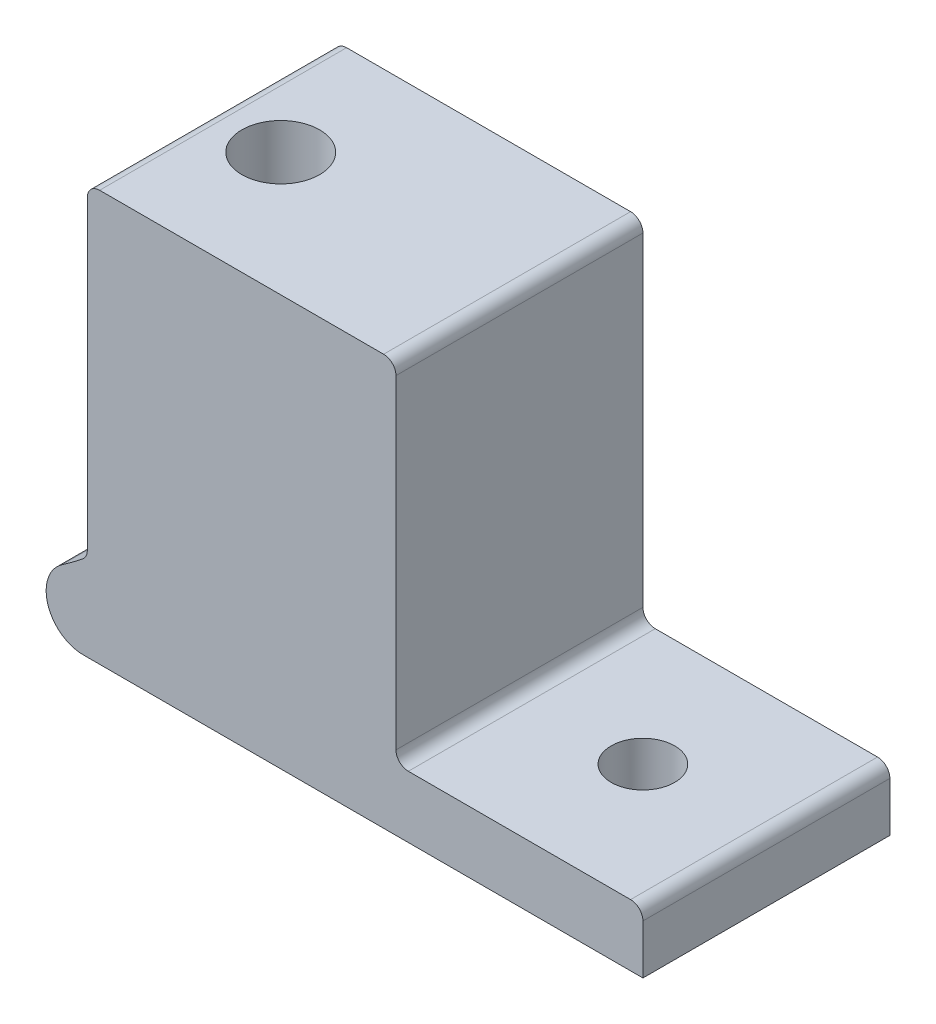
ISO-10303-21;
HEADER;
FILE_DESCRIPTION(('STEP AP214'),'2;1');
FILE_NAME('part.step','',(''),(''),'','','');
FILE_SCHEMA(('AUTOMOTIVE_DESIGN { 1 0 10303 214 1 1 1 1 }'));
ENDSEC;
DATA;
#1=APPLICATION_CONTEXT('core data for automotive mechanical design processes');
#2=APPLICATION_PROTOCOL_DEFINITION('international standard','automotive_design',2000,#1);
#3=PRODUCT_CONTEXT('',#1,'mechanical');
#4=PRODUCT('Part','Part','',(#3));
#5=PRODUCT_RELATED_PRODUCT_CATEGORY('part','',(#4));
#6=PRODUCT_DEFINITION_FORMATION('','',#4);
#7=PRODUCT_DEFINITION_CONTEXT('part definition',#1,'design');
#8=PRODUCT_DEFINITION('design','',#6,#7);
#9=PRODUCT_DEFINITION_SHAPE('','',#8);
#10=(LENGTH_UNIT() NAMED_UNIT(*) SI_UNIT(.MILLI.,.METRE.));
#11=(NAMED_UNIT(*) PLANE_ANGLE_UNIT() SI_UNIT($,.RADIAN.));
#12=(NAMED_UNIT(*) SI_UNIT($,.STERADIAN.) SOLID_ANGLE_UNIT());
#13=UNCERTAINTY_MEASURE_WITH_UNIT(LENGTH_MEASURE(1.E-05),#10,'distance_accuracy_value','');
#14=(GEOMETRIC_REPRESENTATION_CONTEXT(3) GLOBAL_UNCERTAINTY_ASSIGNED_CONTEXT((#13)) GLOBAL_UNIT_ASSIGNED_CONTEXT((#10,
#11,#12)) REPRESENTATION_CONTEXT('',''));
#15=CARTESIAN_POINT('',(0.,0.,0.));
#16=DIRECTION('',(0.,0.,1.));
#17=DIRECTION('',(1.,0.,0.));
#18=AXIS2_PLACEMENT_3D('',#15,#16,#17);
#19=CARTESIAN_POINT('',(0.,0.,12.7));
#20=DIRECTION('',(0.,0.,-1.));
#21=DIRECTION('',(-1.,0.,0.));
#22=AXIS2_PLACEMENT_3D('',#19,#20,#21);
#23=CYLINDRICAL_SURFACE('',#22,38.9999999999999);
#24=CARTESIAN_POINT('',(32.,-22.2934968096077,4.00000000000001));
#25=CARTESIAN_POINT('',(31.8331234852324,-22.5330333355611,3.99999561565649));
#26=CARTESIAN_POINT('',(31.6635558711314,-22.7706840225816,3.98958198545416));
#27=CARTESIAN_POINT('',(31.3200684337904,-23.2408696283417,3.94559163945568));
#28=CARTESIAN_POINT('',(31.1461472387668,-23.4734028901184,3.91200753196114));
#29=CARTESIAN_POINT('',(30.7966355837724,-23.9300954895692,3.81895995582314));
#30=CARTESIAN_POINT('',(30.6210585926834,-24.1542922306732,3.75963261479427));
#31=CARTESIAN_POINT('',(30.2700882068309,-24.5926896437965,3.61159739335414));
#32=CARTESIAN_POINT('',(30.0946948566352,-24.8069024503946,3.52292629939554));
#33=CARTESIAN_POINT('',(29.7626084617116,-25.2041339526433,3.32092946173891));
#34=CARTESIAN_POINT('',(29.6055933370013,-25.388256352554,3.21034083019939));
#35=CARTESIAN_POINT('',(29.2994471967593,-25.7409544753002,2.9574292754624));
#36=CARTESIAN_POINT('',(29.1503125648886,-25.9095373560926,2.81512106753181));
#37=CARTESIAN_POINT('',(28.8891350266257,-26.2001891655891,2.52088448795227));
#38=CARTESIAN_POINT('',(28.7749512642583,-26.3254010510597,2.37401032842275));
#39=CARTESIAN_POINT('',(28.5627667376646,-26.5554659473417,2.05475912698604));
#40=CARTESIAN_POINT('',(28.4647418163483,-26.6603493907313,1.88242089837858));
#41=CARTESIAN_POINT('',(28.3107418389157,-26.8237151431477,1.55391144355306));
#42=CARTESIAN_POINT('',(28.2502590906013,-26.8873289057192,1.4024552633309));
#43=CARTESIAN_POINT('',(28.1728399223758,-26.9683607242981,1.16608268807006));
#44=CARTESIAN_POINT('',(28.1492465561929,-26.9929777890882,1.08573802733644));
#45=CARTESIAN_POINT('',(28.1068979233288,-27.0370713345232,0.922420753107216));
#46=CARTESIAN_POINT('',(28.0881406222463,-27.0565499768432,0.839449261195342));
#47=CARTESIAN_POINT('',(28.0557177327903,-27.0901689362472,0.67086156328984));
#48=CARTESIAN_POINT('',(28.0420864990272,-27.1042732429072,0.585231536100381));
#49=CARTESIAN_POINT('',(28.0203814036598,-27.1267113753442,0.412558123955896));
#50=CARTESIAN_POINT('',(28.0123050489618,-27.1350477898276,0.325515391017926));
#51=CARTESIAN_POINT('',(28.001882511118,-27.1458032718856,0.150719503609792));
#52=CARTESIAN_POINT('',(27.9995360996976,-27.1482225751913,0.0629663775806375));
#53=CARTESIAN_POINT('',(28.000616867332,-27.147107497238,-0.112438053063213));
#54=CARTESIAN_POINT('',(28.0040436153386,-27.143573560473,-0.200089364790828));
#55=CARTESIAN_POINT('',(28.0216876848783,-27.1253636430137,-0.444825611954987));
#56=CARTESIAN_POINT('',(28.0423682770908,-27.1040110045358,-0.601038633682248));
#57=CARTESIAN_POINT('',(28.1009423083963,-27.0432758763674,-0.906419975364352));
#58=CARTESIAN_POINT('',(28.1388372304785,-27.0038918332957,-1.05558768715362));
#59=CARTESIAN_POINT('',(28.231142139416,-26.9073818397128,-1.34916074454141));
#60=CARTESIAN_POINT('',(28.2861030482257,-26.8496622845943,-1.49319511823172));
#61=CARTESIAN_POINT('',(28.4089978305736,-26.7195969632575,-1.76846839636876));
#62=CARTESIAN_POINT('',(28.476938317702,-26.6472437395194,-1.89970072596614));
#63=CARTESIAN_POINT('',(28.6607842593177,-26.4496828011217,-2.21305074611287));
#64=CARTESIAN_POINT('',(28.7832984430327,-26.316517527582,-2.38628749319523));
#65=CARTESIAN_POINT('',(29.0432042509759,-26.0294048218929,-2.70173097014501));
#66=CARTESIAN_POINT('',(29.1806311678749,-25.8754078672634,-2.84386157775276));
#67=CARTESIAN_POINT('',(29.4259024511423,-25.5957242696129,-3.06487418537874));
#68=CARTESIAN_POINT('',(29.5317934852491,-25.4735245563879,-3.15049521753796));
#69=CARTESIAN_POINT('',(29.746436755882,-25.2225445166779,-3.30743714133564));
#70=CARTESIAN_POINT('',(29.8551902839873,-25.0937611940408,-3.37875144806797));
#71=CARTESIAN_POINT('',(30.0742311525285,-24.8308264008898,-3.50822104930676));
#72=CARTESIAN_POINT('',(30.1845197893215,-24.6966701879378,-3.56636440304415));
#73=CARTESIAN_POINT('',(30.4055367017579,-24.4240490090574,-3.6705054496288));
#74=CARTESIAN_POINT('',(30.5162651068742,-24.2855826771278,-3.71649924720499));
#75=CARTESIAN_POINT('',(30.7975713202804,-23.9287599560444,-3.81932548170611));
#76=CARTESIAN_POINT('',(30.9679028485226,-23.707962378115,-3.86841975437551));
#77=CARTESIAN_POINT('',(31.3056233319979,-23.2601963806112,-3.94306462157423));
#78=CARTESIAN_POINT('',(31.4730106384673,-23.033224673998,-3.9686024119455));
#79=CARTESIAN_POINT('',(31.8037736032666,-22.5743248802979,-3.99864046567475));
#80=CARTESIAN_POINT('',(31.9671400323692,-22.3423873292926,-4.00309613910871));
#81=CARTESIAN_POINT('',(32.2885247339905,-21.8753641447709,-3.99281753785568));
#82=CARTESIAN_POINT('',(32.4465437178357,-21.6402789358139,-3.97808582588489));
#83=CARTESIAN_POINT('',(32.8066360824857,-21.0918025316393,-3.92331378911935));
#84=CARTESIAN_POINT('',(33.0064845266695,-20.7776048416269,-3.87664430495575));
#85=CARTESIAN_POINT('',(33.3948214165825,-20.147528866901,-3.75445848689101));
#86=CARTESIAN_POINT('',(33.5833025707148,-19.8316496419876,-3.67892386046869));
#87=CARTESIAN_POINT('',(33.8567690477923,-19.3585243234692,-3.54439075279952));
#88=CARTESIAN_POINT('',(33.946409025608,-19.2008814582685,-3.49598908673134));
#89=CARTESIAN_POINT('',(34.1224874037347,-18.8861942879374,-3.39197736543692));
#90=CARTESIAN_POINT('',(34.2089261640226,-18.7291499172989,-3.33636812388622));
#91=CARTESIAN_POINT('',(34.3784085399956,-18.4162066998216,-3.21774206127125));
#92=CARTESIAN_POINT('',(34.4614548102237,-18.2603070387894,-3.15473118747083));
#93=CARTESIAN_POINT('',(34.624047593286,-17.9500969586862,-3.02083885152895));
#94=CARTESIAN_POINT('',(34.703594744365,-17.7957862537531,-2.94995883311281));
#95=CARTESIAN_POINT('',(34.8566037189528,-17.4941389002198,-2.80192813742431));
#96=CARTESIAN_POINT('',(34.9301771595907,-17.3467331169292,-2.72503476640373));
#97=CARTESIAN_POINT('',(35.073550077429,-17.0549844698317,-2.56223856437977));
#98=CARTESIAN_POINT('',(35.143348360812,-16.9106425835863,-2.47633290837743));
#99=CARTESIAN_POINT('',(35.2783103596822,-16.6272461959109,-2.29465226581627));
#100=CARTESIAN_POINT('',(35.3434964049279,-16.4881679894788,-2.19893124604909));
#101=CARTESIAN_POINT('',(35.4688127305216,-16.2168297184321,-1.99540352756164));
#102=CARTESIAN_POINT('',(35.5289484497714,-16.0845623799025,-1.88761012988319));
#103=CARTESIAN_POINT('',(35.6273085329194,-15.8652186661753,-1.68859335887966));
#104=CARTESIAN_POINT('',(35.6670344467006,-15.7756589389949,-1.60087388732926));
#105=CARTESIAN_POINT('',(35.7423084705634,-15.6043624770655,-1.41601815169941));
#106=CARTESIAN_POINT('',(35.7778497108162,-15.5226386459517,-1.31886686786488));
#107=CARTESIAN_POINT('',(35.8436810682844,-15.3700195346358,-1.11264925548068));
#108=CARTESIAN_POINT('',(35.8739042174521,-15.2992635279415,-1.00345576822602));
#109=CARTESIAN_POINT('',(35.9262579816299,-15.1759183104945,-0.773471513801771));
#110=CARTESIAN_POINT('',(35.9484165559271,-15.1232663700455,-0.652722683596371));
#111=CARTESIAN_POINT('',(35.9764397146394,-15.0564491206479,-0.441949547245692));
#112=CARTESIAN_POINT('',(35.9852528451757,-15.0353517034432,-0.354537108079343));
#113=CARTESIAN_POINT('',(35.9970618872016,-15.007057749595,-0.177112750037109));
#114=CARTESIAN_POINT('',(36.0000638605286,-14.9998467275694,-0.0871036394603439));
#115=CARTESIAN_POINT('',(35.9999339538616,-15.0001585179039,0.0930189463202792));
#116=CARTESIAN_POINT('',(35.99679282301,-15.007703551305,0.18313237437775));
#117=CARTESIAN_POINT('',(35.9847009261625,-15.0366729259116,0.360703620690087));
#118=CARTESIAN_POINT('',(35.9757442794672,-15.0581113161564,0.448158656945923));
#119=CARTESIAN_POINT('',(35.9490912505516,-15.1216520573422,0.646265613057406));
#120=CARTESIAN_POINT('',(35.9294999761425,-15.1682069737965,0.755213033619187));
#121=CARTESIAN_POINT('',(35.8836295583801,-15.2764054617157,0.963800414249555));
#122=CARTESIAN_POINT('',(35.8573340611517,-15.3380859152497,1.06341678837833));
#123=CARTESIAN_POINT('',(35.8036813100519,-15.4628713348557,1.24071593808089));
#124=CARTESIAN_POINT('',(35.7769488320657,-15.5246549847933,1.31954289518636));
#125=CARTESIAN_POINT('',(35.7205160575522,-15.6540639493489,1.47115956928917));
#126=CARTESIAN_POINT('',(35.690813428637,-15.7216938491485,1.5439444582032));
#127=CARTESIAN_POINT('',(35.6289440437246,-15.8614059690126,1.68423623055962));
#128=CARTESIAN_POINT('',(35.5967726772869,-15.9334964682616,1.75173273837105));
#129=CARTESIAN_POINT('',(35.5303819637944,-16.0809982594587,1.88195226787881));
#130=CARTESIAN_POINT('',(35.4961618199262,-16.156410840383,1.94467341050564));
#131=CARTESIAN_POINT('',(35.4234053235253,-16.3153466316576,2.07025081881465));
#132=CARTESIAN_POINT('',(35.3847359688728,-16.3990612423068,2.13278646508085));
#133=CARTESIAN_POINT('',(35.3055933685726,-16.5687615273557,2.25349822187993));
#134=CARTESIAN_POINT('',(35.2651197150926,-16.6547477134004,2.31167333873672));
#135=CARTESIAN_POINT('',(35.1411973554905,-16.9154729406536,2.48040659877113));
#136=CARTESIAN_POINT('',(35.0552980961979,-17.0928672223979,2.58508701528598));
#137=CARTESIAN_POINT('',(34.8776940218406,-17.4524163050696,2.78143927706432));
#138=CARTESIAN_POINT('',(34.7859761563079,-17.634581227572,2.87308026937074));
#139=CARTESIAN_POINT('',(34.5974296014117,-18.0016784732674,3.04460022697552));
#140=CARTESIAN_POINT('',(34.5006024776561,-18.1866099364187,3.12448276725752));
#141=CARTESIAN_POINT('',(34.31462641548,-18.534841155914,3.26408647597369));
#142=CARTESIAN_POINT('',(34.2260432320792,-18.6979365376185,3.32507974996146));
#143=CARTESIAN_POINT('',(34.0453576393008,-19.0249454183811,3.43917442883727));
#144=CARTESIAN_POINT('',(33.9532548133543,-19.1888590122707,3.49227489590928));
#145=CARTESIAN_POINT('',(33.6717436813298,-19.681376479901,3.64009562097048));
#146=CARTESIAN_POINT('',(33.4772139311139,-20.0106045925507,3.72327486373805));
#147=CARTESIAN_POINT('',(33.0754123828524,-20.6679884389352,3.85855201842651));
#148=CARTESIAN_POINT('',(32.8681304464118,-20.9961430951405,3.91062483812514));
#149=CARTESIAN_POINT('',(32.4421694437065,-21.6484899618778,3.98134033061521));
#150=CARTESIAN_POINT('',(32.2234982794064,-21.9726847320057,4.00000587196607));
#151=CARTESIAN_POINT('',(32.,-22.2934968096077,4.00000000000001));
#152=B_SPLINE_CURVE_WITH_KNOTS('',3,(#24,#25,#26,#27,#28,#29,#30,#31,#32,#33,#34,#35,#36,#37,
#38,#39,#40,#41,#42,#43,#44,#45,#46,#47,#48,#49,#50,#51,#52,#53,#54,#55,#56,#57,#58,#59,#60,#61,
#62,#63,#64,#65,#66,#67,#68,#69,#70,#71,#72,#73,#74,#75,#76,#77,#78,#79,#80,#81,#82,#83,#84,#85,
#86,#87,#88,#89,#90,#91,#92,#93,#94,#95,#96,#97,#98,#99,#100,#101,#102,#103,#104,#105,#106,#107,
#108,#109,#110,#111,#112,#113,#114,#115,#116,#117,#118,#119,#120,#121,#122,#123,#124,#125,#126,
#127,#128,#129,#130,#131,#132,#133,#134,#135,#136,#137,#138,#139,#140,#141,#142,#143,#144,#145,
#146,#147,#148,#149,#150,#151),.UNSPECIFIED.,.T.,.F.,(4,2,2,2,2,2,2,2,2,2,2,2,2,2,2,2,2,2,2,2,2,
2,2,2,2,2,2,2,2,2,2,2,2,2,2,2,2,2,2,2,2,2,2,2,2,2,2,2,2,2,2,2,2,2,2,2,2,2,2,2,2,2,2,4),(0.,
0.8755380127671,1.7513554633337,2.62259706537347,3.49275055722056,4.28892308088249,
5.08472701210021,5.75506174786586,6.42438507754154,6.94723829715634,7.20880300669068,
7.47025750285047,7.73343428040174,7.996492863974,8.25954096741718,8.52256943145839,
8.99721002601393,9.47189151791273,9.96385082441888,10.4560614747756,11.2033920938203,
11.9525316064623,12.5007165360407,13.0491532007987,13.5980851051321,14.1471927895875,
14.9953392801155,15.8439465106309,16.694347795702,17.5446355106527,18.6691045354758,
19.7942873477454,20.3572368475648,20.9201228503158,21.4825596247431,22.044893380793,
22.5900698526394,23.1354177295169,23.6779134155244,24.2198171667633,24.6138608809755,
25.0085427200083,25.4078854360364,25.8058301662,26.0757599535417,26.3454080148801,
26.6154624500298,26.8857903927268,27.2440234845355,27.603138931719,27.9136769303882,
28.2244607312152,28.535839757513,28.8473406825281,29.1814510626819,29.5156373497826,
30.1844567726314,30.8548332902975,31.5250055670226,32.1108975120206,32.6968590166048,
33.8693290778815,35.0427436479687,36.2153546632507),.UNSPECIFIED.);
#153=CARTESIAN_POINT('',(32.,-22.2934968096077,4.00000000000001));
#154=VERTEX_POINT('',#153);
#155=EDGE_CURVE('E198',#154,#154,#152,.T.);
#156=ORIENTED_EDGE('',*,*,#155,.T.);
#157=EDGE_LOOP('',(#156));
#158=FACE_BOUND('',#157,.T.);
#159=CARTESIAN_POINT('',(0.,0.,-9.5885));
#160=DIRECTION('',(0.,0.,1.));
#161=DIRECTION('',(1.,0.,0.));
#162=AXIS2_PLACEMENT_3D('',#159,#160,#161);
#163=CIRCLE('',#162,38.9999999999999);
#164=CARTESIAN_POINT('',(38.8749996784563,-3.12000000000001,-9.5885));
#165=VERTEX_POINT('',#164);
#166=CARTESIAN_POINT('',(24.3267259696025,-30.482952671942,-9.5885));
#167=VERTEX_POINT('',#166);
#168=EDGE_CURVE('E58',#165,#167,#163,.F.);
#169=ORIENTED_EDGE('',*,*,#168,.T.);
#170=DIRECTION('',(0.,0.,-1.));
#171=VECTOR('',#170,1.);
#172=CARTESIAN_POINT('',(24.3267259696025,-30.482952671942,12.7));
#173=LINE('',#172,#171);
#174=CARTESIAN_POINT('',(24.3267259696025,-30.482952671942,-12.7));
#175=VERTEX_POINT('',#174);
#176=EDGE_CURVE('E353',#167,#175,#173,.T.);
#177=ORIENTED_EDGE('',*,*,#176,.T.);
#178=CARTESIAN_POINT('',(0.,0.,-12.7));
#179=DIRECTION('',(0.,0.,-1.));
#180=DIRECTION('',(-1.,0.,0.));
#181=AXIS2_PLACEMENT_3D('',#178,#179,#180);
#182=CIRCLE('',#181,38.9999999999999);
#183=CARTESIAN_POINT('',(22.2097753749831,-32.0581639803779,-12.7));
#184=VERTEX_POINT('',#183);
#185=EDGE_CURVE('E278',#175,#184,#182,.T.);
#186=ORIENTED_EDGE('',*,*,#185,.T.);
#187=DIRECTION('',(0.,0.,-1.));
#188=VECTOR('',#187,1.);
#189=CARTESIAN_POINT('',(22.2097753749831,-32.0581639803779,12.7));
#190=LINE('',#189,#188);
#191=CARTESIAN_POINT('',(22.2097753749831,-32.0581639803779,12.7));
#192=VERTEX_POINT('',#191);
#193=EDGE_CURVE('E274',#192,#184,#190,.T.);
#194=ORIENTED_EDGE('',*,*,#193,.F.);
#195=CARTESIAN_POINT('',(0.,0.,12.7));
#196=DIRECTION('',(0.,0.,-1.));
#197=DIRECTION('',(-1.,0.,0.));
#198=AXIS2_PLACEMENT_3D('',#195,#196,#197);
#199=CIRCLE('',#198,38.9999999999999);
#200=CARTESIAN_POINT('',(24.3267259696025,-30.482952671942,12.7));
#201=VERTEX_POINT('',#200);
#202=EDGE_CURVE('E305',#201,#192,#199,.T.);
#203=ORIENTED_EDGE('',*,*,#202,.F.);
#204=DIRECTION('',(0.,0.,-1.));
#205=VECTOR('',#204,1.);
#206=CARTESIAN_POINT('',(24.3267259696025,-30.482952671942,12.7));
#207=LINE('',#206,#205);
#208=CARTESIAN_POINT('',(24.3267259696025,-30.482952671942,9.5885));
#209=VERTEX_POINT('',#208);
#210=EDGE_CURVE('E351',#201,#209,#207,.T.);
#211=ORIENTED_EDGE('',*,*,#210,.T.);
#212=CARTESIAN_POINT('',(0.,0.,9.5885));
#213=DIRECTION('',(0.,0.,-1.));
#214=DIRECTION('',(-1.,0.,0.));
#215=AXIS2_PLACEMENT_3D('',#212,#213,#214);
#216=CIRCLE('',#215,38.9999999999999);
#217=CARTESIAN_POINT('',(38.8749996784563,-3.12000000000001,9.5885));
#218=VERTEX_POINT('',#217);
#219=EDGE_CURVE('E65',#209,#218,#216,.F.);
#220=ORIENTED_EDGE('',*,*,#219,.T.);
#221=DIRECTION('',(0.,0.,-1.));
#222=VECTOR('',#221,1.);
#223=CARTESIAN_POINT('',(38.8749996784563,-3.12000000000001,12.7));
#224=LINE('',#223,#222);
#225=EDGE_CURVE('E176',#218,#165,#224,.T.);
#226=ORIENTED_EDGE('',*,*,#225,.T.);
#227=EDGE_LOOP('',(#169,#177,#186,#194,#203,#211,#220,#226));
#228=FACE_BOUND('',#227,.T.);
#229=ADVANCED_FACE('F43',(#158,#228),#23,.F.);
#230=CARTESIAN_POINT('',(24.3794995846929,-35.1899999999994,12.7));
#231=DIRECTION('',(0.,0.,-1.));
#232=DIRECTION('',(-1.,0.,0.));
#233=AXIS2_PLACEMENT_3D('',#230,#231,#232);
#234=CYLINDRICAL_SURFACE('',#233,3.81000000000001);
#235=CARTESIAN_POINT('',(24.3794995846929,-35.1899999999994,-12.7));
#236=DIRECTION('',(0.,0.,1.));
#237=DIRECTION('',(1.,0.,0.));
#238=AXIS2_PLACEMENT_3D('',#235,#236,#237);
#239=CIRCLE('',#238,3.81000000000001);
#240=CARTESIAN_POINT('',(24.3794995846929,-38.9999999999994,-12.7));
#241=VERTEX_POINT('',#240);
#242=EDGE_CURVE('E268',#184,#241,#239,.T.);
#243=ORIENTED_EDGE('',*,*,#242,.T.);
#244=DIRECTION('',(0.,0.,-1.));
#245=VECTOR('',#244,1.);
#246=CARTESIAN_POINT('',(24.3794995846929,-38.9999999999994,12.7));
#247=LINE('',#246,#245);
#248=CARTESIAN_POINT('',(24.3794995846929,-38.9999999999994,12.7));
#249=VERTEX_POINT('',#248);
#250=EDGE_CURVE('E271',#249,#241,#247,.T.);
#251=ORIENTED_EDGE('',*,*,#250,.F.);
#252=CARTESIAN_POINT('',(24.3794995846929,-35.1899999999994,12.7));
#253=DIRECTION('',(0.,0.,1.));
#254=DIRECTION('',(1.,0.,0.));
#255=AXIS2_PLACEMENT_3D('',#252,#253,#254);
#256=CIRCLE('',#255,3.81000000000001);
#257=EDGE_CURVE('E367',#192,#249,#256,.T.);
#258=ORIENTED_EDGE('',*,*,#257,.F.);
#259=ORIENTED_EDGE('',*,*,#193,.T.);
#260=EDGE_LOOP('',(#243,#251,#258,#259));
#261=FACE_BOUND('',#260,.T.);
#262=ADVANCED_FACE('F255',(#261),#234,.T.);
#263=CARTESIAN_POINT('',(24.3794995846929,-38.9999999999994,12.7));
#264=DIRECTION('',(0.,1.,0.));
#265=DIRECTION('',(-1.,0.,0.));
#266=AXIS2_PLACEMENT_3D('',#263,#264,#265);
#267=PLANE('',#266);
#268=DIRECTION('',(0.,0.,-1.));
#269=VECTOR('',#268,1.);
#270=CARTESIAN_POINT('',(81.9545479700796,-38.9999999999997,12.7));
#271=LINE('',#270,#269);
#272=CARTESIAN_POINT('',(81.9545479700796,-38.9999999999997,12.7));
#273=VERTEX_POINT('',#272);
#274=CARTESIAN_POINT('',(81.9545479700796,-38.9999999999997,-12.7));
#275=VERTEX_POINT('',#274);
#276=EDGE_CURVE('E175',#273,#275,#271,.T.);
#277=ORIENTED_EDGE('',*,*,#276,.F.);
#278=DIRECTION('',(1.,0.,0.));
#279=VECTOR('',#278,1.);
#280=CARTESIAN_POINT('',(24.3794995846929,-38.9999999999994,12.7));
#281=LINE('',#280,#279);
#282=EDGE_CURVE('E283',#249,#273,#281,.T.);
#283=ORIENTED_EDGE('',*,*,#282,.F.);
#284=ORIENTED_EDGE('',*,*,#250,.T.);
#285=DIRECTION('',(1.,0.,0.));
#286=VECTOR('',#285,1.);
#287=CARTESIAN_POINT('',(24.3794995846929,-38.9999999999994,-12.7));
#288=LINE('',#287,#286);
#289=EDGE_CURVE('E277',#241,#275,#288,.T.);
#290=ORIENTED_EDGE('',*,*,#289,.T.);
#291=EDGE_LOOP('',(#277,#283,#284,#290));
#292=FACE_BOUND('',#291,.T.);
#293=CARTESIAN_POINT('',(69.2545479700795,-38.9999999999997,0.));
#294=DIRECTION('',(0.,1.,0.));
#295=DIRECTION('',(0.,0.,1.));
#296=AXIS2_PLACEMENT_3D('',#293,#294,#295);
#297=CIRCLE('',#296,3.26389999999999);
#298=CARTESIAN_POINT('',(69.2545479700795,-38.9999999999997,3.26389999999999));
#299=VERTEX_POINT('',#298);
#300=EDGE_CURVE('E206',#299,#299,#297,.T.);
#301=ORIENTED_EDGE('',*,*,#300,.T.);
#302=EDGE_LOOP('',(#301));
#303=FACE_BOUND('',#302,.T.);
#304=ADVANCED_FACE('F252',(#292,#303),#267,.F.);
#305=CARTESIAN_POINT('',(81.9545479700796,-38.9999999999997,12.7));
#306=DIRECTION('',(-1.,0.,0.));
#307=DIRECTION('',(0.,0.,1.));
#308=AXIS2_PLACEMENT_3D('',#305,#306,#307);
#309=PLANE('',#308);
#310=DIRECTION('',(0.,1.,0.));
#311=VECTOR('',#310,1.);
#312=CARTESIAN_POINT('',(81.9545479700796,-38.9999999999997,-12.7));
#313=LINE('',#312,#311);
#314=CARTESIAN_POINT('',(81.9545479700796,-33.9199999999994,-12.7));
#315=VERTEX_POINT('',#314);
#316=EDGE_CURVE('E288',#275,#315,#313,.T.);
#317=ORIENTED_EDGE('',*,*,#316,.T.);
#318=DIRECTION('',(0.,0.,-1.));
#319=VECTOR('',#318,1.);
#320=CARTESIAN_POINT('',(81.9545479700796,-33.9199999999994,12.7));
#321=LINE('',#320,#319);
#322=CARTESIAN_POINT('',(81.9545479700796,-33.9199999999994,12.7));
#323=VERTEX_POINT('',#322);
#324=EDGE_CURVE('E326',#315,#323,#321,.F.);
#325=ORIENTED_EDGE('',*,*,#324,.T.);
#326=DIRECTION('',(0.,1.,0.));
#327=VECTOR('',#326,1.);
#328=CARTESIAN_POINT('',(81.9545479700796,-38.9999999999997,12.7));
#329=LINE('',#328,#327);
#330=EDGE_CURVE('E404',#273,#323,#329,.T.);
#331=ORIENTED_EDGE('',*,*,#330,.F.);
#332=ORIENTED_EDGE('',*,*,#276,.T.);
#333=EDGE_LOOP('',(#317,#325,#331,#332));
#334=FACE_BOUND('',#333,.T.);
#335=ADVANCED_FACE('F248',(#334),#309,.F.);
#336=CARTESIAN_POINT('',(81.9545479700796,-32.6499999999994,12.7));
#337=DIRECTION('',(0.,-1.,0.));
#338=DIRECTION('',(0.,0.,-1.));
#339=AXIS2_PLACEMENT_3D('',#336,#337,#338);
#340=PLANE('',#339);
#341=CARTESIAN_POINT('',(69.2545479700795,-32.6499999999994,0.));
#342=DIRECTION('',(0.,-1.,0.));
#343=DIRECTION('',(0.,0.,-1.));
#344=AXIS2_PLACEMENT_3D('',#341,#342,#343);
#345=CIRCLE('',#344,3.26389999999999);
#346=CARTESIAN_POINT('',(69.2545479700795,-32.6499999999994,-3.26389999999999));
#347=VERTEX_POINT('',#346);
#348=EDGE_CURVE('E310',#347,#347,#345,.T.);
#349=ORIENTED_EDGE('',*,*,#348,.T.);
#350=EDGE_LOOP('',(#349));
#351=FACE_BOUND('',#350,.T.);
#352=DIRECTION('',(-1.,0.,0.));
#353=VECTOR('',#352,1.);
#354=CARTESIAN_POINT('',(81.9545479700796,-32.6499999999994,12.7));
#355=LINE('',#354,#353);
#356=CARTESIAN_POINT('',(80.6845479700796,-32.6499999999994,12.7));
#357=VERTEX_POINT('',#356);
#358=CARTESIAN_POINT('',(57.8245479700793,-32.6499999999994,12.7));
#359=VERTEX_POINT('',#358);
#360=EDGE_CURVE('E398',#357,#359,#355,.T.);
#361=ORIENTED_EDGE('',*,*,#360,.F.);
#362=DIRECTION('',(0.,0.,-1.));
#363=VECTOR('',#362,1.);
#364=CARTESIAN_POINT('',(80.6845479700796,-32.6499999999994,12.7));
#365=LINE('',#364,#363);
#366=CARTESIAN_POINT('',(80.6845479700796,-32.6499999999994,-12.7));
#367=VERTEX_POINT('',#366);
#368=EDGE_CURVE('E317',#357,#367,#365,.T.);
#369=ORIENTED_EDGE('',*,*,#368,.T.);
#370=DIRECTION('',(-1.,0.,0.));
#371=VECTOR('',#370,1.);
#372=CARTESIAN_POINT('',(81.9545479700796,-32.6499999999994,-12.7));
#373=LINE('',#372,#371);
#374=CARTESIAN_POINT('',(57.8245479700793,-32.6499999999994,-12.7));
#375=VERTEX_POINT('',#374);
#376=EDGE_CURVE('E290',#367,#375,#373,.T.);
#377=ORIENTED_EDGE('',*,*,#376,.T.);
#378=DIRECTION('',(0.,0.,-1.));
#379=VECTOR('',#378,1.);
#380=CARTESIAN_POINT('',(57.8245479700793,-32.6499999999994,12.7));
#381=LINE('',#380,#379);
#382=EDGE_CURVE('E181',#375,#359,#381,.F.);
#383=ORIENTED_EDGE('',*,*,#382,.T.);
#384=EDGE_LOOP('',(#361,#369,#377,#383));
#385=FACE_BOUND('',#384,.T.);
#386=ADVANCED_FACE('F244',(#351,#385),#340,.F.);
#387=CARTESIAN_POINT('',(56.5545479700793,-32.6499999999994,12.7));
#388=DIRECTION('',(-1.,0.,0.));
#389=DIRECTION('',(0.,0.,1.));
#390=AXIS2_PLACEMENT_3D('',#387,#388,#389);
#391=PLANE('',#390);
#392=DIRECTION('',(0.,1.,0.));
#393=VECTOR('',#392,1.);
#394=CARTESIAN_POINT('',(56.5545479700793,-32.6499999999994,12.7));
#395=LINE('',#394,#393);
#396=CARTESIAN_POINT('',(56.5545479700793,-31.3799999999994,12.7));
#397=VERTEX_POINT('',#396);
#398=CARTESIAN_POINT('',(56.5545479700793,1.96000000000029,12.7));
#399=VERTEX_POINT('',#398);
#400=EDGE_CURVE('E389',#397,#399,#395,.T.);
#401=ORIENTED_EDGE('',*,*,#400,.F.);
#402=DIRECTION('',(0.,0.,-1.));
#403=VECTOR('',#402,1.);
#404=CARTESIAN_POINT('',(56.5545479700793,-31.3799999999994,-12.7));
#405=LINE('',#404,#403);
#406=CARTESIAN_POINT('',(56.5545479700793,-31.3799999999994,-12.7));
#407=VERTEX_POINT('',#406);
#408=EDGE_CURVE('E336',#397,#407,#405,.T.);
#409=ORIENTED_EDGE('',*,*,#408,.T.);
#410=DIRECTION('',(0.,1.,0.));
#411=VECTOR('',#410,1.);
#412=CARTESIAN_POINT('',(56.5545479700793,-32.6499999999994,-12.7));
#413=LINE('',#412,#411);
#414=CARTESIAN_POINT('',(56.5545479700793,1.96000000000029,-12.7));
#415=VERTEX_POINT('',#414);
#416=EDGE_CURVE('E296',#407,#415,#413,.T.);
#417=ORIENTED_EDGE('',*,*,#416,.T.);
#418=DIRECTION('',(0.,0.,-1.));
#419=VECTOR('',#418,1.);
#420=CARTESIAN_POINT('',(56.5545479700793,1.96000000000029,12.7));
#421=LINE('',#420,#419);
#422=EDGE_CURVE('E334',#415,#399,#421,.F.);
#423=ORIENTED_EDGE('',*,*,#422,.T.);
#424=EDGE_LOOP('',(#401,#409,#417,#423));
#425=FACE_BOUND('',#424,.T.);
#426=ADVANCED_FACE('F240',(#425),#391,.F.);
#427=CARTESIAN_POINT('',(56.5545479700793,3.23000000000029,12.7));
#428=DIRECTION('',(0.,-1.,0.));
#429=DIRECTION('',(0.,0.,-1.));
#430=AXIS2_PLACEMENT_3D('',#427,#428,#429);
#431=PLANE('',#430);
#432=CARTESIAN_POINT('',(32.,3.23000000000029,0.));
#433=DIRECTION('',(0.,1.,0.));
#434=DIRECTION('',(0.,0.,1.));
#435=AXIS2_PLACEMENT_3D('',#432,#433,#434);
#436=CIRCLE('',#435,4.00000000000001);
#437=CARTESIAN_POINT('',(32.,3.23000000000029,4.00000000000001));
#438=VERTEX_POINT('',#437);
#439=EDGE_CURVE('E191',#438,#438,#436,.T.);
#440=ORIENTED_EDGE('',*,*,#439,.F.);
#441=EDGE_LOOP('',(#440));
#442=FACE_BOUND('',#441,.T.);
#443=DIRECTION('',(-1.,0.,0.));
#444=VECTOR('',#443,1.);
#445=CARTESIAN_POINT('',(56.5545479700793,3.23000000000029,12.7));
#446=LINE('',#445,#444);
#447=CARTESIAN_POINT('',(55.2845479700793,3.23000000000029,12.7));
#448=VERTEX_POINT('',#447);
#449=CARTESIAN_POINT('',(26.0745479700796,3.23000000000029,12.7));
#450=VERTEX_POINT('',#449);
#451=EDGE_CURVE('E370',#448,#450,#446,.T.);
#452=ORIENTED_EDGE('',*,*,#451,.F.);
#453=DIRECTION('',(0.,0.,-1.));
#454=VECTOR('',#453,1.);
#455=CARTESIAN_POINT('',(55.2845479700793,3.23000000000029,12.7));
#456=LINE('',#455,#454);
#457=CARTESIAN_POINT('',(55.2845479700793,3.23000000000029,-12.7));
#458=VERTEX_POINT('',#457);
#459=EDGE_CURVE('E341',#448,#458,#456,.T.);
#460=ORIENTED_EDGE('',*,*,#459,.T.);
#461=DIRECTION('',(-1.,0.,0.));
#462=VECTOR('',#461,1.);
#463=CARTESIAN_POINT('',(56.5545479700793,3.23000000000029,-12.7));
#464=LINE('',#463,#462);
#465=CARTESIAN_POINT('',(26.0745479700796,3.23000000000029,-12.7));
#466=VERTEX_POINT('',#465);
#467=EDGE_CURVE('E299',#458,#466,#464,.T.);
#468=ORIENTED_EDGE('',*,*,#467,.T.);
#469=DIRECTION('',(0.,0.,-1.));
#470=VECTOR('',#469,1.);
#471=CARTESIAN_POINT('',(26.0745479700796,3.23000000000029,12.7));
#472=LINE('',#471,#470);
#473=EDGE_CURVE('E339',#466,#450,#472,.F.);
#474=ORIENTED_EDGE('',*,*,#473,.T.);
#475=EDGE_LOOP('',(#452,#460,#468,#474));
#476=FACE_BOUND('',#475,.T.);
#477=ADVANCED_FACE('F237',(#442,#476),#431,.F.);
#478=CARTESIAN_POINT('',(24.8045479700796,3.23000000000029,12.7));
#479=DIRECTION('',(1.,0.,0.));
#480=DIRECTION('',(0.,0.,-1.));
#481=AXIS2_PLACEMENT_3D('',#478,#479,#480);
#482=PLANE('',#481);
#483=DIRECTION('',(0.,-1.,0.));
#484=VECTOR('',#483,1.);
#485=CARTESIAN_POINT('',(24.8045479700796,3.23000000000029,12.7));
#486=LINE('',#485,#484);
#487=CARTESIAN_POINT('',(24.8045479700796,1.96000000000029,12.7));
#488=VERTEX_POINT('',#487);
#489=CARTESIAN_POINT('',(24.8045479700796,-29.4903026746762,12.7));
#490=VERTEX_POINT('',#489);
#491=EDGE_CURVE('E306',#488,#490,#486,.T.);
#492=ORIENTED_EDGE('',*,*,#491,.F.);
#493=DIRECTION('',(0.,0.,-1.));
#494=VECTOR('',#493,1.);
#495=CARTESIAN_POINT('',(24.8045479700796,1.96000000000029,12.7));
#496=LINE('',#495,#494);
#497=CARTESIAN_POINT('',(24.8045479700796,1.96000000000029,-12.7));
#498=VERTEX_POINT('',#497);
#499=EDGE_CURVE('E348',#488,#498,#496,.T.);
#500=ORIENTED_EDGE('',*,*,#499,.T.);
#501=DIRECTION('',(0.,-1.,0.));
#502=VECTOR('',#501,1.);
#503=CARTESIAN_POINT('',(24.8045479700796,3.23000000000029,-12.7));
#504=LINE('',#503,#502);
#505=CARTESIAN_POINT('',(24.8045479700796,-29.4903026746762,-12.7));
#506=VERTEX_POINT('',#505);
#507=EDGE_CURVE('E302',#498,#506,#504,.T.);
#508=ORIENTED_EDGE('',*,*,#507,.T.);
#509=DIRECTION('',(0.,0.,1.));
#510=VECTOR('',#509,1.);
#511=CARTESIAN_POINT('',(24.8045479700796,-29.4903026746762,-9.5885));
#512=LINE('',#511,#510);
#513=CARTESIAN_POINT('',(24.8045479700796,-29.4903026746762,-9.5885));
#514=VERTEX_POINT('',#513);
#515=EDGE_CURVE('E346',#506,#514,#512,.T.);
#516=ORIENTED_EDGE('',*,*,#515,.T.);
#517=DIRECTION('',(0.,1.,0.));
#518=VECTOR('',#517,1.);
#519=CARTESIAN_POINT('',(24.8045479700796,3.23000000000029,-9.5885));
#520=LINE('',#519,#518);
#521=CARTESIAN_POINT('',(24.8045479700796,-3.12000000000001,-9.5885));
#522=VERTEX_POINT('',#521);
#523=EDGE_CURVE('E171',#514,#522,#520,.T.);
#524=ORIENTED_EDGE('',*,*,#523,.T.);
#525=DIRECTION('',(0.,0.,-1.));
#526=VECTOR('',#525,1.);
#527=CARTESIAN_POINT('',(24.8045479700796,-3.12000000000001,12.7));
#528=LINE('',#527,#526);
#529=CARTESIAN_POINT('',(24.8045479700796,-3.12000000000001,9.5885));
#530=VERTEX_POINT('',#529);
#531=EDGE_CURVE('E162',#530,#522,#528,.T.);
#532=ORIENTED_EDGE('',*,*,#531,.F.);
#533=DIRECTION('',(0.,-1.,0.));
#534=VECTOR('',#533,1.);
#535=CARTESIAN_POINT('',(24.8045479700796,3.23000000000029,9.5885));
#536=LINE('',#535,#534);
#537=CARTESIAN_POINT('',(24.8045479700796,-29.4903026746762,9.5885));
#538=VERTEX_POINT('',#537);
#539=EDGE_CURVE('E168',#530,#538,#536,.T.);
#540=ORIENTED_EDGE('',*,*,#539,.T.);
#541=DIRECTION('',(0.,0.,1.));
#542=VECTOR('',#541,1.);
#543=CARTESIAN_POINT('',(24.8045479700796,-29.4903026746762,12.7));
#544=LINE('',#543,#542);
#545=EDGE_CURVE('E344',#538,#490,#544,.T.);
#546=ORIENTED_EDGE('',*,*,#545,.T.);
#547=EDGE_LOOP('',(#492,#500,#508,#516,#524,#532,#540,#546));
#548=FACE_BOUND('',#547,.T.);
#549=ADVANCED_FACE('F165',(#548),#482,.F.);
#550=CARTESIAN_POINT('',(24.8045479700796,-3.12000000000001,12.7));
#551=DIRECTION('',(0.,1.,0.));
#552=DIRECTION('',(0.,0.,1.));
#553=AXIS2_PLACEMENT_3D('',#550,#551,#552);
#554=PLANE('',#553);
#555=CARTESIAN_POINT('',(32.,-3.12000000000001,0.));
#556=DIRECTION('',(0.,1.,0.));
#557=DIRECTION('',(0.,0.,1.));
#558=AXIS2_PLACEMENT_3D('',#555,#556,#557);
#559=CIRCLE('',#558,4.00000000000001);
#560=CARTESIAN_POINT('',(32.,-3.12000000000001,4.00000000000001));
#561=VERTEX_POINT('',#560);
#562=EDGE_CURVE('E195',#561,#561,#559,.T.);
#563=ORIENTED_EDGE('',*,*,#562,.T.);
#564=EDGE_LOOP('',(#563));
#565=FACE_BOUND('',#564,.T.);
#566=ORIENTED_EDGE('',*,*,#225,.F.);
#567=DIRECTION('',(-1.,0.,0.));
#568=VECTOR('',#567,1.);
#569=CARTESIAN_POINT('',(24.8045479700796,-3.12000000000001,9.5885));
#570=LINE('',#569,#568);
#571=EDGE_CURVE('E179',#218,#530,#570,.T.);
#572=ORIENTED_EDGE('',*,*,#571,.T.);
#573=ORIENTED_EDGE('',*,*,#531,.T.);
#574=DIRECTION('',(1.,0.,0.));
#575=VECTOR('',#574,1.);
#576=CARTESIAN_POINT('',(24.8045479700796,-3.12000000000001,-9.5885));
#577=LINE('',#576,#575);
#578=EDGE_CURVE('E182',#522,#165,#577,.T.);
#579=ORIENTED_EDGE('',*,*,#578,.T.);
#580=EDGE_LOOP('',(#566,#572,#573,#579));
#581=FACE_BOUND('',#580,.T.);
#582=ADVANCED_FACE('F180',(#565,#581),#554,.F.);
#583=CARTESIAN_POINT('',(0.,0.,12.7));
#584=DIRECTION('',(0.,0.,-1.));
#585=DIRECTION('',(-1.,0.,0.));
#586=AXIS2_PLACEMENT_3D('',#583,#584,#585);
#587=PLANE('',#586);
#588=ORIENTED_EDGE('',*,*,#330,.T.);
#589=CARTESIAN_POINT('',(80.6845479700796,-33.9199999999994,12.7));
#590=DIRECTION('',(0.,0.,-1.));
#591=DIRECTION('',(-1.,0.,0.));
#592=AXIS2_PLACEMENT_3D('',#589,#590,#591);
#593=CIRCLE('',#592,1.27);
#594=EDGE_CURVE('E332',#323,#357,#593,.F.);
#595=ORIENTED_EDGE('',*,*,#594,.T.);
#596=ORIENTED_EDGE('',*,*,#360,.T.);
#597=CARTESIAN_POINT('',(57.8245479700793,-31.3799999999994,12.7));
#598=DIRECTION('',(0.,0.,-1.));
#599=DIRECTION('',(-1.,0.,0.));
#600=AXIS2_PLACEMENT_3D('',#597,#598,#599);
#601=CIRCLE('',#600,1.27);
#602=EDGE_CURVE('E357',#359,#397,#601,.T.);
#603=ORIENTED_EDGE('',*,*,#602,.T.);
#604=ORIENTED_EDGE('',*,*,#400,.T.);
#605=CARTESIAN_POINT('',(55.2845479700793,1.96000000000029,12.7));
#606=DIRECTION('',(0.,0.,-1.));
#607=DIRECTION('',(-1.,0.,0.));
#608=AXIS2_PLACEMENT_3D('',#605,#606,#607);
#609=CIRCLE('',#608,1.27);
#610=EDGE_CURVE('E330',#399,#448,#609,.F.);
#611=ORIENTED_EDGE('',*,*,#610,.T.);
#612=ORIENTED_EDGE('',*,*,#451,.T.);
#613=CARTESIAN_POINT('',(26.0745479700796,1.96000000000029,12.7));
#614=DIRECTION('',(0.,0.,-1.));
#615=DIRECTION('',(-1.,0.,0.));
#616=AXIS2_PLACEMENT_3D('',#613,#614,#615);
#617=CIRCLE('',#616,1.27);
#618=EDGE_CURVE('E328',#450,#488,#617,.F.);
#619=ORIENTED_EDGE('',*,*,#618,.T.);
#620=ORIENTED_EDGE('',*,*,#491,.T.);
#621=CARTESIAN_POINT('',(23.5345479700796,-29.4903026746762,12.7));
#622=DIRECTION('',(0.,0.,-1.));
#623=DIRECTION('',(-1.,0.,0.));
#624=AXIS2_PLACEMENT_3D('',#621,#622,#623);
#625=CIRCLE('',#624,1.27);
#626=EDGE_CURVE('E51',#490,#201,#625,.T.);
#627=ORIENTED_EDGE('',*,*,#626,.T.);
#628=ORIENTED_EDGE('',*,*,#202,.T.);
#629=ORIENTED_EDGE('',*,*,#257,.T.);
#630=ORIENTED_EDGE('',*,*,#282,.T.);
#631=EDGE_LOOP('',(#588,#595,#596,#603,#604,#611,#612,#619,#620,#627,#628,#629,#630));
#632=FACE_BOUND('',#631,.T.);
#633=ADVANCED_FACE('F225',(#632),#587,.F.);
#634=CARTESIAN_POINT('',(0.,0.,-12.7));
#635=DIRECTION('',(0.,0.,-1.));
#636=DIRECTION('',(-1.,0.,0.));
#637=AXIS2_PLACEMENT_3D('',#634,#635,#636);
#638=PLANE('',#637);
#639=ORIENTED_EDGE('',*,*,#376,.F.);
#640=CARTESIAN_POINT('',(80.6845479700796,-33.9199999999994,-12.7));
#641=DIRECTION('',(0.,0.,-1.));
#642=DIRECTION('',(-1.,0.,0.));
#643=AXIS2_PLACEMENT_3D('',#640,#641,#642);
#644=CIRCLE('',#643,1.27);
#645=EDGE_CURVE('E324',#367,#315,#644,.T.);
#646=ORIENTED_EDGE('',*,*,#645,.T.);
#647=ORIENTED_EDGE('',*,*,#316,.F.);
#648=ORIENTED_EDGE('',*,*,#289,.F.);
#649=ORIENTED_EDGE('',*,*,#242,.F.);
#650=ORIENTED_EDGE('',*,*,#185,.F.);
#651=CARTESIAN_POINT('',(23.5345479700796,-29.4903026746762,-12.7));
#652=DIRECTION('',(0.,0.,-1.));
#653=DIRECTION('',(-1.,0.,0.));
#654=AXIS2_PLACEMENT_3D('',#651,#652,#653);
#655=CIRCLE('',#654,1.27);
#656=EDGE_CURVE('E359',#175,#506,#655,.F.);
#657=ORIENTED_EDGE('',*,*,#656,.T.);
#658=ORIENTED_EDGE('',*,*,#507,.F.);
#659=CARTESIAN_POINT('',(26.0745479700796,1.96000000000029,-12.7));
#660=DIRECTION('',(0.,0.,-1.));
#661=DIRECTION('',(-1.,0.,0.));
#662=AXIS2_PLACEMENT_3D('',#659,#660,#661);
#663=CIRCLE('',#662,1.27);
#664=EDGE_CURVE('E320',#498,#466,#663,.T.);
#665=ORIENTED_EDGE('',*,*,#664,.T.);
#666=ORIENTED_EDGE('',*,*,#467,.F.);
#667=CARTESIAN_POINT('',(55.2845479700793,1.96000000000029,-12.7));
#668=DIRECTION('',(0.,0.,-1.));
#669=DIRECTION('',(-1.,0.,0.));
#670=AXIS2_PLACEMENT_3D('',#667,#668,#669);
#671=CIRCLE('',#670,1.27);
#672=EDGE_CURVE('E322',#458,#415,#671,.T.);
#673=ORIENTED_EDGE('',*,*,#672,.T.);
#674=ORIENTED_EDGE('',*,*,#416,.F.);
#675=CARTESIAN_POINT('',(57.8245479700793,-31.3799999999994,-12.7));
#676=DIRECTION('',(0.,0.,-1.));
#677=DIRECTION('',(-1.,0.,0.));
#678=AXIS2_PLACEMENT_3D('',#675,#676,#677);
#679=CIRCLE('',#678,1.27);
#680=EDGE_CURVE('E355',#407,#375,#679,.F.);
#681=ORIENTED_EDGE('',*,*,#680,.T.);
#682=EDGE_LOOP('',(#639,#646,#647,#648,#649,#650,#657,#658,#665,#666,#673,#674,#681));
#683=FACE_BOUND('',#682,.T.);
#684=ADVANCED_FACE('F223',(#683),#638,.T.);
#685=CARTESIAN_POINT('',(69.2545479700795,-38.9999999999997,0.));
#686=DIRECTION('',(0.,1.,0.));
#687=DIRECTION('',(0.,0.,1.));
#688=AXIS2_PLACEMENT_3D('',#685,#686,#687);
#689=CYLINDRICAL_SURFACE('',#688,3.26389999999999);
#690=ORIENTED_EDGE('',*,*,#300,.F.);
#691=EDGE_LOOP('',(#690));
#692=FACE_BOUND('',#691,.T.);
#693=ORIENTED_EDGE('',*,*,#348,.F.);
#694=EDGE_LOOP('',(#693));
#695=FACE_BOUND('',#694,.T.);
#696=ADVANCED_FACE('F220',(#692,#695),#689,.F.);
#697=CARTESIAN_POINT('',(32.,-28.5199999999997,0.));
#698=DIRECTION('',(0.,1.,0.));
#699=DIRECTION('',(0.,0.,1.));
#700=AXIS2_PLACEMENT_3D('',#697,#698,#699);
#701=CYLINDRICAL_SURFACE('',#700,4.00000000000001);
#702=ORIENTED_EDGE('',*,*,#439,.T.);
#703=EDGE_LOOP('',(#702));
#704=FACE_BOUND('',#703,.T.);
#705=ORIENTED_EDGE('',*,*,#562,.F.);
#706=EDGE_LOOP('',(#705));
#707=FACE_BOUND('',#706,.T.);
#708=ADVANCED_FACE('F217',(#704,#707),#701,.F.);
#709=CARTESIAN_POINT('',(32.,-28.5199999999997,0.));
#710=DIRECTION('',(0.,1.,0.));
#711=DIRECTION('',(0.,0.,1.));
#712=AXIS2_PLACEMENT_3D('',#709,#710,#711);
#713=CIRCLE('',#712,4.00000000000001);
#714=CARTESIAN_POINT('',(32.,-28.5199999999997,4.00000000000001));
#715=VERTEX_POINT('',#714);
#716=EDGE_CURVE('E192',#715,#715,#713,.T.);
#717=ORIENTED_EDGE('',*,*,#716,.F.);
#718=EDGE_LOOP('',(#717));
#719=FACE_BOUND('',#718,.T.);
#720=ORIENTED_EDGE('',*,*,#155,.F.);
#721=EDGE_LOOP('',(#720));
#722=FACE_BOUND('',#721,.T.);
#723=ADVANCED_FACE('F211',(#719,#722),#701,.F.);
#724=CARTESIAN_POINT('',(32.,-28.5199999999997,0.));
#725=DIRECTION('',(0.,1.,0.));
#726=DIRECTION('',(0.,0.,1.));
#727=AXIS2_PLACEMENT_3D('',#724,#725,#726);
#728=PLANE('',#727);
#729=ORIENTED_EDGE('',*,*,#716,.T.);
#730=EDGE_LOOP('',(#729));
#731=FACE_BOUND('',#730,.T.);
#732=ADVANCED_FACE('F216',(#731),#728,.T.);
#733=CARTESIAN_POINT('',(98.8990202450997,3.23000000000029,-9.5885));
#734=DIRECTION('',(0.,0.,1.));
#735=DIRECTION('',(1.,0.,0.));
#736=AXIS2_PLACEMENT_3D('',#733,#734,#735);
#737=PLANE('',#736);
#738=ORIENTED_EDGE('',*,*,#168,.F.);
#739=ORIENTED_EDGE('',*,*,#578,.F.);
#740=ORIENTED_EDGE('',*,*,#523,.F.);
#741=CARTESIAN_POINT('',(23.5345479700796,-29.4903026746762,-9.5885));
#742=DIRECTION('',(0.,0.,1.));
#743=DIRECTION('',(1.,0.,0.));
#744=AXIS2_PLACEMENT_3D('',#741,#742,#743);
#745=CIRCLE('',#744,1.27);
#746=EDGE_CURVE('E361',#514,#167,#745,.F.);
#747=ORIENTED_EDGE('',*,*,#746,.T.);
#748=EDGE_LOOP('',(#738,#739,#740,#747));
#749=FACE_BOUND('',#748,.T.);
#750=ADVANCED_FACE('F417',(#749),#737,.T.);
#751=CARTESIAN_POINT('',(98.8990202450997,3.23000000000029,9.5885));
#752=DIRECTION('',(0.,0.,-1.));
#753=DIRECTION('',(-1.,0.,0.));
#754=AXIS2_PLACEMENT_3D('',#751,#752,#753);
#755=PLANE('',#754);
#756=ORIENTED_EDGE('',*,*,#219,.F.);
#757=CARTESIAN_POINT('',(23.5345479700796,-29.4903026746762,9.5885));
#758=DIRECTION('',(0.,0.,-1.));
#759=DIRECTION('',(-1.,0.,0.));
#760=AXIS2_PLACEMENT_3D('',#757,#758,#759);
#761=CIRCLE('',#760,1.27);
#762=EDGE_CURVE('E11',#209,#538,#761,.F.);
#763=ORIENTED_EDGE('',*,*,#762,.T.);
#764=ORIENTED_EDGE('',*,*,#539,.F.);
#765=ORIENTED_EDGE('',*,*,#571,.F.);
#766=EDGE_LOOP('',(#756,#763,#764,#765));
#767=FACE_BOUND('',#766,.T.);
#768=ADVANCED_FACE('F184',(#767),#755,.T.);
#769=CARTESIAN_POINT('',(80.6845479700796,-33.9199999999994,12.7));
#770=DIRECTION('',(0.,0.,-1.));
#771=DIRECTION('',(-1.,0.,0.));
#772=AXIS2_PLACEMENT_3D('',#769,#770,#771);
#773=CYLINDRICAL_SURFACE('',#772,1.27);
#774=ORIENTED_EDGE('',*,*,#594,.F.);
#775=ORIENTED_EDGE('',*,*,#324,.F.);
#776=ORIENTED_EDGE('',*,*,#645,.F.);
#777=ORIENTED_EDGE('',*,*,#368,.F.);
#778=EDGE_LOOP('',(#774,#775,#776,#777));
#779=FACE_BOUND('',#778,.T.);
#780=ADVANCED_FACE('F401',(#779),#773,.T.);
#781=CARTESIAN_POINT('',(57.8245479700793,-31.3799999999994,12.7));
#782=DIRECTION('',(0.,0.,1.));
#783=DIRECTION('',(1.,0.,0.));
#784=AXIS2_PLACEMENT_3D('',#781,#782,#783);
#785=CYLINDRICAL_SURFACE('',#784,1.27);
#786=ORIENTED_EDGE('',*,*,#602,.F.);
#787=ORIENTED_EDGE('',*,*,#382,.F.);
#788=ORIENTED_EDGE('',*,*,#680,.F.);
#789=ORIENTED_EDGE('',*,*,#408,.F.);
#790=EDGE_LOOP('',(#786,#787,#788,#789));
#791=FACE_BOUND('',#790,.T.);
#792=ADVANCED_FACE('F392',(#791),#785,.F.);
#793=CARTESIAN_POINT('',(55.2845479700793,1.96000000000029,12.7));
#794=DIRECTION('',(0.,0.,-1.));
#795=DIRECTION('',(-1.,0.,0.));
#796=AXIS2_PLACEMENT_3D('',#793,#794,#795);
#797=CYLINDRICAL_SURFACE('',#796,1.27);
#798=ORIENTED_EDGE('',*,*,#610,.F.);
#799=ORIENTED_EDGE('',*,*,#422,.F.);
#800=ORIENTED_EDGE('',*,*,#672,.F.);
#801=ORIENTED_EDGE('',*,*,#459,.F.);
#802=EDGE_LOOP('',(#798,#799,#800,#801));
#803=FACE_BOUND('',#802,.T.);
#804=ADVANCED_FACE('F383',(#803),#797,.T.);
#805=CARTESIAN_POINT('',(26.0745479700796,1.96000000000029,12.7));
#806=DIRECTION('',(0.,0.,-1.));
#807=DIRECTION('',(-1.,0.,0.));
#808=AXIS2_PLACEMENT_3D('',#805,#806,#807);
#809=CYLINDRICAL_SURFACE('',#808,1.27);
#810=ORIENTED_EDGE('',*,*,#618,.F.);
#811=ORIENTED_EDGE('',*,*,#473,.F.);
#812=ORIENTED_EDGE('',*,*,#664,.F.);
#813=ORIENTED_EDGE('',*,*,#499,.F.);
#814=EDGE_LOOP('',(#810,#811,#812,#813));
#815=FACE_BOUND('',#814,.T.);
#816=ADVANCED_FACE('F374',(#815),#809,.T.);
#817=CARTESIAN_POINT('',(23.5345479700796,-29.4903026746762,12.7));
#818=DIRECTION('',(0.,0.,-1.));
#819=DIRECTION('',(-1.,0.,0.));
#820=AXIS2_PLACEMENT_3D('',#817,#818,#819);
#821=CYLINDRICAL_SURFACE('',#820,1.27);
#822=ORIENTED_EDGE('',*,*,#746,.F.);
#823=ORIENTED_EDGE('',*,*,#515,.F.);
#824=ORIENTED_EDGE('',*,*,#656,.F.);
#825=ORIENTED_EDGE('',*,*,#176,.F.);
#826=EDGE_LOOP('',(#822,#823,#824,#825));
#827=FACE_BOUND('',#826,.T.);
#828=ADVANCED_FACE('F415',(#827),#821,.F.);
#829=CARTESIAN_POINT('',(23.5345479700796,-29.4903026746762,12.7));
#830=DIRECTION('',(0.,0.,-1.));
#831=DIRECTION('',(-1.,0.,0.));
#832=AXIS2_PLACEMENT_3D('',#829,#830,#831);
#833=CYLINDRICAL_SURFACE('',#832,1.27);
#834=ORIENTED_EDGE('',*,*,#762,.F.);
#835=ORIENTED_EDGE('',*,*,#210,.F.);
#836=ORIENTED_EDGE('',*,*,#626,.F.);
#837=ORIENTED_EDGE('',*,*,#545,.F.);
#838=EDGE_LOOP('',(#834,#835,#836,#837));
#839=FACE_BOUND('',#838,.T.);
#840=ADVANCED_FACE('F45',(#839),#833,.F.);
#841=CLOSED_SHELL('',(#229,#262,#304,#335,#386,#426,#477,#549,#582,#633,#684,#696,#708,#723,
#732,#750,#768,#780,#792,#804,#816,#828,#840));
#842=MANIFOLD_SOLID_BREP('B2',#841);
#843=ADVANCED_BREP_SHAPE_REPRESENTATION('',(#18,#842),#14);
#844=SHAPE_DEFINITION_REPRESENTATION(#9,#843);
ENDSEC;
END-ISO-10303-21;
